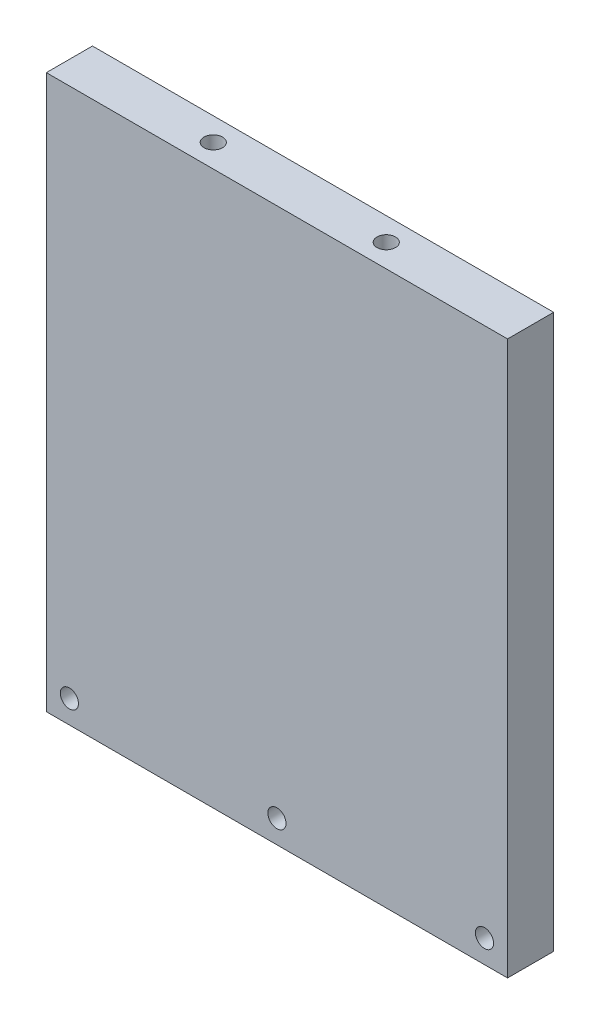
ISO-10303-21;
HEADER;
FILE_DESCRIPTION(('STEP AP214'),'2;1');
FILE_NAME('part.step','',(''),(''),'','','');
FILE_SCHEMA(('AUTOMOTIVE_DESIGN { 1 0 10303 214 1 1 1 1 }'));
ENDSEC;
DATA;
#1=APPLICATION_CONTEXT('core data for automotive mechanical design processes');
#2=APPLICATION_PROTOCOL_DEFINITION('international standard','automotive_design',2000,#1);
#3=PRODUCT_CONTEXT('',#1,'mechanical');
#4=PRODUCT('Part','Part','',(#3));
#5=PRODUCT_RELATED_PRODUCT_CATEGORY('part','',(#4));
#6=PRODUCT_DEFINITION_FORMATION('','',#4);
#7=PRODUCT_DEFINITION_CONTEXT('part definition',#1,'design');
#8=PRODUCT_DEFINITION('design','',#6,#7);
#9=PRODUCT_DEFINITION_SHAPE('','',#8);
#10=(LENGTH_UNIT() NAMED_UNIT(*) SI_UNIT(.MILLI.,.METRE.));
#11=(NAMED_UNIT(*) PLANE_ANGLE_UNIT() SI_UNIT($,.RADIAN.));
#12=(NAMED_UNIT(*) SI_UNIT($,.STERADIAN.) SOLID_ANGLE_UNIT());
#13=UNCERTAINTY_MEASURE_WITH_UNIT(LENGTH_MEASURE(1.E-05),#10,'distance_accuracy_value','');
#14=(GEOMETRIC_REPRESENTATION_CONTEXT(3) GLOBAL_UNCERTAINTY_ASSIGNED_CONTEXT((#13)) GLOBAL_UNIT_ASSIGNED_CONTEXT((#10,
#11,#12)) REPRESENTATION_CONTEXT('',''));
#15=CARTESIAN_POINT('',(0.,0.,0.));
#16=DIRECTION('',(0.,0.,1.));
#17=DIRECTION('',(1.,0.,0.));
#18=AXIS2_PLACEMENT_3D('',#15,#16,#17);
#19=CARTESIAN_POINT('',(127.,-152.4,25.4));
#20=DIRECTION('',(-1.,0.,0.));
#21=DIRECTION('',(0.,0.,1.));
#22=AXIS2_PLACEMENT_3D('',#19,#20,#21);
#23=PLANE('',#22);
#24=DIRECTION('',(0.,1.,0.));
#25=VECTOR('',#24,1.);
#26=CARTESIAN_POINT('',(127.,-152.4,0.));
#27=LINE('',#26,#25);
#28=CARTESIAN_POINT('',(127.,-152.4,0.));
#29=VERTEX_POINT('',#28);
#30=CARTESIAN_POINT('',(127.,152.4,0.));
#31=VERTEX_POINT('',#30);
#32=EDGE_CURVE('E125',#29,#31,#27,.T.);
#33=ORIENTED_EDGE('',*,*,#32,.T.);
#34=DIRECTION('',(0.,0.,-1.));
#35=VECTOR('',#34,1.);
#36=CARTESIAN_POINT('',(127.,152.4,25.4));
#37=LINE('',#36,#35);
#38=CARTESIAN_POINT('',(127.,152.4,25.4));
#39=VERTEX_POINT('',#38);
#40=EDGE_CURVE('E11',#39,#31,#37,.T.);
#41=ORIENTED_EDGE('',*,*,#40,.F.);
#42=DIRECTION('',(0.,1.,0.));
#43=VECTOR('',#42,1.);
#44=CARTESIAN_POINT('',(127.,-152.4,25.4));
#45=LINE('',#44,#43);
#46=CARTESIAN_POINT('',(127.,-152.4,25.4));
#47=VERTEX_POINT('',#46);
#48=EDGE_CURVE('E126',#47,#39,#45,.T.);
#49=ORIENTED_EDGE('',*,*,#48,.F.);
#50=DIRECTION('',(0.,0.,-1.));
#51=VECTOR('',#50,1.);
#52=CARTESIAN_POINT('',(127.,-152.4,25.4));
#53=LINE('',#52,#51);
#54=EDGE_CURVE('E132',#47,#29,#53,.T.);
#55=ORIENTED_EDGE('',*,*,#54,.T.);
#56=EDGE_LOOP('',(#33,#41,#49,#55));
#57=FACE_BOUND('',#56,.T.);
#58=ADVANCED_FACE('F32',(#57),#23,.F.);
#59=CARTESIAN_POINT('',(-127.,152.4,25.4));
#60=DIRECTION('',(0.,-1.,0.));
#61=DIRECTION('',(0.,0.,-1.));
#62=AXIS2_PLACEMENT_3D('',#59,#60,#61);
#63=PLANE('',#62);
#64=CARTESIAN_POINT('',(-47.754,152.4,12.7));
#65=DIRECTION('',(0.,1.,0.));
#66=DIRECTION('',(0.,0.,1.));
#67=AXIS2_PLACEMENT_3D('',#64,#65,#66);
#68=CIRCLE('',#67,5.1);
#69=CARTESIAN_POINT('',(-47.754,152.4,17.8));
#70=VERTEX_POINT('',#69);
#71=EDGE_CURVE('E97',#70,#70,#68,.T.);
#72=ORIENTED_EDGE('',*,*,#71,.F.);
#73=EDGE_LOOP('',(#72));
#74=FACE_BOUND('',#73,.T.);
#75=CARTESIAN_POINT('',(47.498,152.4,12.7));
#76=DIRECTION('',(0.,1.,0.));
#77=DIRECTION('',(0.,0.,1.));
#78=AXIS2_PLACEMENT_3D('',#75,#76,#77);
#79=CIRCLE('',#78,5.09999999999999);
#80=CARTESIAN_POINT('',(47.498,152.4,17.8));
#81=VERTEX_POINT('',#80);
#82=EDGE_CURVE('E96',#81,#81,#79,.T.);
#83=ORIENTED_EDGE('',*,*,#82,.F.);
#84=EDGE_LOOP('',(#83));
#85=FACE_BOUND('',#84,.T.);
#86=DIRECTION('',(-1.,0.,0.));
#87=VECTOR('',#86,1.);
#88=CARTESIAN_POINT('',(-127.,152.4,0.));
#89=LINE('',#88,#87);
#90=CARTESIAN_POINT('',(-127.,152.4,0.));
#91=VERTEX_POINT('',#90);
#92=EDGE_CURVE('E135',#31,#91,#89,.T.);
#93=ORIENTED_EDGE('',*,*,#92,.T.);
#94=DIRECTION('',(0.,0.,-1.));
#95=VECTOR('',#94,1.);
#96=CARTESIAN_POINT('',(-127.,152.4,25.4));
#97=LINE('',#96,#95);
#98=CARTESIAN_POINT('',(-127.,152.4,25.4));
#99=VERTEX_POINT('',#98);
#100=EDGE_CURVE('E40',#99,#91,#97,.T.);
#101=ORIENTED_EDGE('',*,*,#100,.F.);
#102=DIRECTION('',(-1.,0.,0.));
#103=VECTOR('',#102,1.);
#104=CARTESIAN_POINT('',(-127.,152.4,25.4));
#105=LINE('',#104,#103);
#106=EDGE_CURVE('E79',#39,#99,#105,.T.);
#107=ORIENTED_EDGE('',*,*,#106,.F.);
#108=ORIENTED_EDGE('',*,*,#40,.T.);
#109=EDGE_LOOP('',(#93,#101,#107,#108));
#110=FACE_BOUND('',#109,.T.);
#111=ADVANCED_FACE('F159',(#74,#85,#110),#63,.F.);
#112=CARTESIAN_POINT('',(-127.,-152.4,25.4));
#113=DIRECTION('',(1.,0.,0.));
#114=DIRECTION('',(0.,0.,-1.));
#115=AXIS2_PLACEMENT_3D('',#112,#113,#114);
#116=PLANE('',#115);
#117=DIRECTION('',(0.,-1.,0.));
#118=VECTOR('',#117,1.);
#119=CARTESIAN_POINT('',(-127.,-152.4,0.));
#120=LINE('',#119,#118);
#121=CARTESIAN_POINT('',(-127.,-152.4,0.));
#122=VERTEX_POINT('',#121);
#123=EDGE_CURVE('E66',#91,#122,#120,.T.);
#124=ORIENTED_EDGE('',*,*,#123,.T.);
#125=DIRECTION('',(0.,0.,-1.));
#126=VECTOR('',#125,1.);
#127=CARTESIAN_POINT('',(-127.,-152.4,25.4));
#128=LINE('',#127,#126);
#129=CARTESIAN_POINT('',(-127.,-152.4,25.4));
#130=VERTEX_POINT('',#129);
#131=EDGE_CURVE('E140',#130,#122,#128,.T.);
#132=ORIENTED_EDGE('',*,*,#131,.F.);
#133=DIRECTION('',(0.,-1.,0.));
#134=VECTOR('',#133,1.);
#135=CARTESIAN_POINT('',(-127.,-152.4,25.4));
#136=LINE('',#135,#134);
#137=EDGE_CURVE('E129',#99,#130,#136,.T.);
#138=ORIENTED_EDGE('',*,*,#137,.F.);
#139=ORIENTED_EDGE('',*,*,#100,.T.);
#140=EDGE_LOOP('',(#124,#132,#138,#139));
#141=FACE_BOUND('',#140,.T.);
#142=ADVANCED_FACE('F142',(#141),#116,.F.);
#143=CARTESIAN_POINT('',(-127.,-152.4,25.4));
#144=DIRECTION('',(0.,1.,0.));
#145=DIRECTION('',(0.,0.,1.));
#146=AXIS2_PLACEMENT_3D('',#143,#144,#145);
#147=PLANE('',#146);
#148=DIRECTION('',(1.,0.,0.));
#149=VECTOR('',#148,1.);
#150=CARTESIAN_POINT('',(-127.,-152.4,0.));
#151=LINE('',#150,#149);
#152=EDGE_CURVE('E72',#122,#29,#151,.T.);
#153=ORIENTED_EDGE('',*,*,#152,.T.);
#154=ORIENTED_EDGE('',*,*,#54,.F.);
#155=DIRECTION('',(1.,0.,0.));
#156=VECTOR('',#155,1.);
#157=CARTESIAN_POINT('',(-127.,-152.4,25.4));
#158=LINE('',#157,#156);
#159=EDGE_CURVE('E48',#130,#47,#158,.T.);
#160=ORIENTED_EDGE('',*,*,#159,.F.);
#161=ORIENTED_EDGE('',*,*,#131,.T.);
#162=EDGE_LOOP('',(#153,#154,#160,#161));
#163=FACE_BOUND('',#162,.T.);
#164=ADVANCED_FACE('F149',(#163),#147,.F.);
#165=CARTESIAN_POINT('',(0.,0.,25.4));
#166=DIRECTION('',(0.,0.,-1.));
#167=DIRECTION('',(-1.,0.,0.));
#168=AXIS2_PLACEMENT_3D('',#165,#166,#167);
#169=PLANE('',#168);
#170=CARTESIAN_POINT('',(-114.3,-139.7,25.4));
#171=DIRECTION('',(0.,0.,1.));
#172=DIRECTION('',(1.,0.,0.));
#173=AXIS2_PLACEMENT_3D('',#170,#171,#172);
#174=CIRCLE('',#173,4.99999999999999);
#175=CARTESIAN_POINT('',(-109.3,-139.7,25.4));
#176=VERTEX_POINT('',#175);
#177=EDGE_CURVE('E107',#176,#176,#174,.T.);
#178=ORIENTED_EDGE('',*,*,#177,.F.);
#179=EDGE_LOOP('',(#178));
#180=FACE_BOUND('',#179,.T.);
#181=CARTESIAN_POINT('',(0.,-139.7,25.4));
#182=DIRECTION('',(0.,0.,1.));
#183=DIRECTION('',(1.,0.,0.));
#184=AXIS2_PLACEMENT_3D('',#181,#182,#183);
#185=CIRCLE('',#184,5.);
#186=CARTESIAN_POINT('',(5.,-139.7,25.4));
#187=VERTEX_POINT('',#186);
#188=EDGE_CURVE('E113',#187,#187,#185,.T.);
#189=ORIENTED_EDGE('',*,*,#188,.F.);
#190=EDGE_LOOP('',(#189));
#191=FACE_BOUND('',#190,.T.);
#192=CARTESIAN_POINT('',(114.3,-139.7,25.4));
#193=DIRECTION('',(0.,0.,1.));
#194=DIRECTION('',(1.,0.,0.));
#195=AXIS2_PLACEMENT_3D('',#192,#193,#194);
#196=CIRCLE('',#195,4.99999999999999);
#197=CARTESIAN_POINT('',(119.3,-139.7,25.4));
#198=VERTEX_POINT('',#197);
#199=EDGE_CURVE('E119',#198,#198,#196,.T.);
#200=ORIENTED_EDGE('',*,*,#199,.F.);
#201=EDGE_LOOP('',(#200));
#202=FACE_BOUND('',#201,.T.);
#203=ORIENTED_EDGE('',*,*,#48,.T.);
#204=ORIENTED_EDGE('',*,*,#106,.T.);
#205=ORIENTED_EDGE('',*,*,#137,.T.);
#206=ORIENTED_EDGE('',*,*,#159,.T.);
#207=EDGE_LOOP('',(#203,#204,#205,#206));
#208=FACE_BOUND('',#207,.T.);
#209=ADVANCED_FACE('F151',(#180,#191,#202,#208),#169,.F.);
#210=CARTESIAN_POINT('',(0.,0.,0.));
#211=DIRECTION('',(0.,0.,-1.));
#212=DIRECTION('',(-1.,0.,0.));
#213=AXIS2_PLACEMENT_3D('',#210,#211,#212);
#214=PLANE('',#213);
#215=CARTESIAN_POINT('',(-114.3,-139.7,0.));
#216=DIRECTION('',(0.,0.,1.));
#217=DIRECTION('',(1.,0.,0.));
#218=AXIS2_PLACEMENT_3D('',#215,#216,#217);
#219=CIRCLE('',#218,4.99999999999999);
#220=CARTESIAN_POINT('',(-109.3,-139.7,0.));
#221=VERTEX_POINT('',#220);
#222=EDGE_CURVE('E110',#221,#221,#219,.T.);
#223=ORIENTED_EDGE('',*,*,#222,.T.);
#224=EDGE_LOOP('',(#223));
#225=FACE_BOUND('',#224,.T.);
#226=CARTESIAN_POINT('',(0.,-139.7,0.));
#227=DIRECTION('',(0.,0.,1.));
#228=DIRECTION('',(1.,0.,0.));
#229=AXIS2_PLACEMENT_3D('',#226,#227,#228);
#230=CIRCLE('',#229,4.99999999999999);
#231=CARTESIAN_POINT('',(4.99999999999999,-139.7,0.));
#232=VERTEX_POINT('',#231);
#233=EDGE_CURVE('E116',#232,#232,#230,.T.);
#234=ORIENTED_EDGE('',*,*,#233,.T.);
#235=EDGE_LOOP('',(#234));
#236=FACE_BOUND('',#235,.T.);
#237=CARTESIAN_POINT('',(114.3,-139.7,0.));
#238=DIRECTION('',(0.,0.,1.));
#239=DIRECTION('',(1.,0.,0.));
#240=AXIS2_PLACEMENT_3D('',#237,#238,#239);
#241=CIRCLE('',#240,4.99999999999999);
#242=CARTESIAN_POINT('',(119.3,-139.7,0.));
#243=VERTEX_POINT('',#242);
#244=EDGE_CURVE('E122',#243,#243,#241,.T.);
#245=ORIENTED_EDGE('',*,*,#244,.T.);
#246=EDGE_LOOP('',(#245));
#247=FACE_BOUND('',#246,.T.);
#248=ORIENTED_EDGE('',*,*,#32,.F.);
#249=ORIENTED_EDGE('',*,*,#152,.F.);
#250=ORIENTED_EDGE('',*,*,#123,.F.);
#251=ORIENTED_EDGE('',*,*,#92,.F.);
#252=EDGE_LOOP('',(#248,#249,#250,#251));
#253=FACE_BOUND('',#252,.T.);
#254=ADVANCED_FACE('F145',(#225,#236,#247,#253),#214,.T.);
#255=CARTESIAN_POINT('',(114.3,-139.7,25.4));
#256=DIRECTION('',(0.,0.,1.));
#257=DIRECTION('',(1.,0.,0.));
#258=AXIS2_PLACEMENT_3D('',#255,#256,#257);
#259=CYLINDRICAL_SURFACE('',#258,4.99999999999999);
#260=ORIENTED_EDGE('',*,*,#244,.F.);
#261=EDGE_LOOP('',(#260));
#262=FACE_BOUND('',#261,.T.);
#263=ORIENTED_EDGE('',*,*,#199,.T.);
#264=EDGE_LOOP('',(#263));
#265=FACE_BOUND('',#264,.T.);
#266=ADVANCED_FACE('F192',(#262,#265),#259,.F.);
#267=CARTESIAN_POINT('',(0.,-139.7,25.4));
#268=DIRECTION('',(0.,0.,1.));
#269=DIRECTION('',(1.,0.,0.));
#270=AXIS2_PLACEMENT_3D('',#267,#268,#269);
#271=CYLINDRICAL_SURFACE('',#270,5.);
#272=ORIENTED_EDGE('',*,*,#233,.F.);
#273=EDGE_LOOP('',(#272));
#274=FACE_BOUND('',#273,.T.);
#275=ORIENTED_EDGE('',*,*,#188,.T.);
#276=EDGE_LOOP('',(#275));
#277=FACE_BOUND('',#276,.T.);
#278=ADVANCED_FACE('F188',(#274,#277),#271,.F.);
#279=CARTESIAN_POINT('',(-114.3,-139.7,25.4));
#280=DIRECTION('',(0.,0.,1.));
#281=DIRECTION('',(1.,0.,0.));
#282=AXIS2_PLACEMENT_3D('',#279,#280,#281);
#283=CYLINDRICAL_SURFACE('',#282,4.99999999999999);
#284=ORIENTED_EDGE('',*,*,#222,.F.);
#285=EDGE_LOOP('',(#284));
#286=FACE_BOUND('',#285,.T.);
#287=ORIENTED_EDGE('',*,*,#177,.T.);
#288=EDGE_LOOP('',(#287));
#289=FACE_BOUND('',#288,.T.);
#290=ADVANCED_FACE('F180',(#286,#289),#283,.F.);
#291=CARTESIAN_POINT('',(47.498,122.4,12.7));
#292=DIRECTION('',(0.,1.,0.));
#293=DIRECTION('',(0.,0.,1.));
#294=AXIS2_PLACEMENT_3D('',#291,#292,#293);
#295=CONICAL_SURFACE('',#294,5.09999999999999,1.02974425867665);
#296=CARTESIAN_POINT('',(47.498,119.335610842959,12.7));
#297=VERTEX_POINT('',#296);
#298=VERTEX_LOOP('',#297);
#299=FACE_BOUND('',#298,.T.);
#300=CARTESIAN_POINT('',(47.498,122.4,12.7));
#301=DIRECTION('',(0.,1.,0.));
#302=DIRECTION('',(0.,0.,1.));
#303=AXIS2_PLACEMENT_3D('',#300,#301,#302);
#304=CIRCLE('',#303,5.09999999999999);
#305=CARTESIAN_POINT('',(47.498,122.4,17.8));
#306=VERTEX_POINT('',#305);
#307=EDGE_CURVE('E100',#306,#306,#304,.T.);
#308=ORIENTED_EDGE('',*,*,#307,.T.);
#309=EDGE_LOOP('',(#308));
#310=FACE_BOUND('',#309,.T.);
#311=ADVANCED_FACE('F174',(#299,#310),#295,.F.);
#312=CARTESIAN_POINT('',(47.498,152.4,12.7));
#313=DIRECTION('',(0.,1.,0.));
#314=DIRECTION('',(0.,0.,1.));
#315=AXIS2_PLACEMENT_3D('',#312,#313,#314);
#316=CYLINDRICAL_SURFACE('',#315,5.09999999999999);
#317=ORIENTED_EDGE('',*,*,#307,.F.);
#318=EDGE_LOOP('',(#317));
#319=FACE_BOUND('',#318,.T.);
#320=ORIENTED_EDGE('',*,*,#82,.T.);
#321=EDGE_LOOP('',(#320));
#322=FACE_BOUND('',#321,.T.);
#323=ADVANCED_FACE('F90',(#319,#322),#316,.F.);
#324=CARTESIAN_POINT('',(-47.754,122.4,12.7));
#325=DIRECTION('',(0.,1.,0.));
#326=DIRECTION('',(0.,0.,1.));
#327=AXIS2_PLACEMENT_3D('',#324,#325,#326);
#328=CONICAL_SURFACE('',#327,5.09999999999999,1.02974425867665);
#329=CARTESIAN_POINT('',(-47.754,119.335610842959,12.7));
#330=VERTEX_POINT('',#329);
#331=VERTEX_LOOP('',#330);
#332=FACE_BOUND('',#331,.T.);
#333=CARTESIAN_POINT('',(-47.754,122.4,12.7));
#334=DIRECTION('',(0.,1.,0.));
#335=DIRECTION('',(0.,0.,1.));
#336=AXIS2_PLACEMENT_3D('',#333,#334,#335);
#337=CIRCLE('',#336,5.09999999999999);
#338=CARTESIAN_POINT('',(-47.754,122.4,17.8));
#339=VERTEX_POINT('',#338);
#340=EDGE_CURVE('E94',#339,#339,#337,.T.);
#341=ORIENTED_EDGE('',*,*,#340,.T.);
#342=EDGE_LOOP('',(#341));
#343=FACE_BOUND('',#342,.T.);
#344=ADVANCED_FACE('F86',(#332,#343),#328,.F.);
#345=CARTESIAN_POINT('',(-47.754,152.4,12.7));
#346=DIRECTION('',(0.,1.,0.));
#347=DIRECTION('',(0.,0.,1.));
#348=AXIS2_PLACEMENT_3D('',#345,#346,#347);
#349=CYLINDRICAL_SURFACE('',#348,5.1);
#350=ORIENTED_EDGE('',*,*,#340,.F.);
#351=EDGE_LOOP('',(#350));
#352=FACE_BOUND('',#351,.T.);
#353=ORIENTED_EDGE('',*,*,#71,.T.);
#354=EDGE_LOOP('',(#353));
#355=FACE_BOUND('',#354,.T.);
#356=ADVANCED_FACE('F89',(#352,#355),#349,.F.);
#357=CLOSED_SHELL('',(#58,#111,#142,#164,#209,#254,#266,#278,#290,#311,#323,#344,#356));
#358=MANIFOLD_SOLID_BREP('B2',#357);
#359=ADVANCED_BREP_SHAPE_REPRESENTATION('',(#18,#358),#14);
#360=SHAPE_DEFINITION_REPRESENTATION(#9,#359);
ENDSEC;
END-ISO-10303-21;
